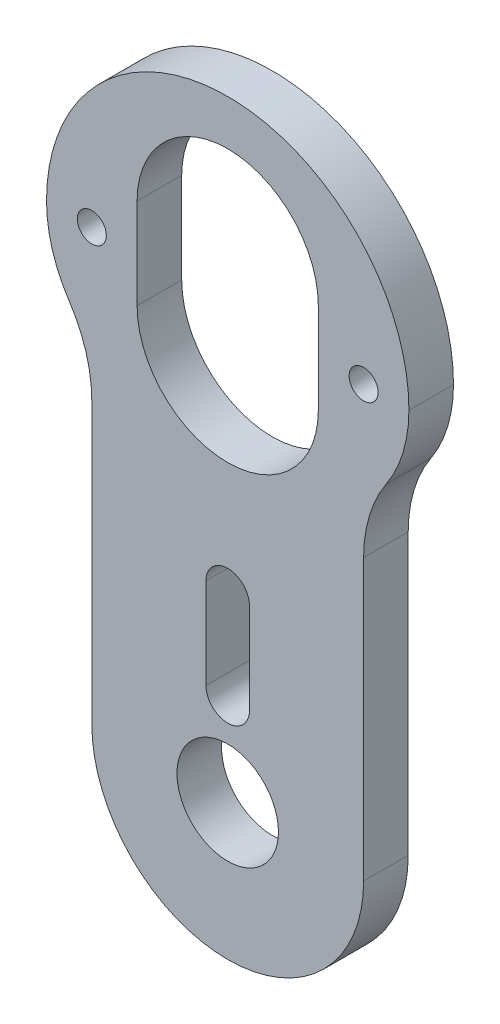
ISO-10303-21;
HEADER;
FILE_DESCRIPTION(('STEP AP214'),'2;1');
FILE_NAME('part.step','',(''),(''),'','','');
FILE_SCHEMA(('AUTOMOTIVE_DESIGN { 1 0 10303 214 1 1 1 1 }'));
ENDSEC;
DATA;
#1=APPLICATION_CONTEXT('core data for automotive mechanical design processes');
#2=APPLICATION_PROTOCOL_DEFINITION('international standard','automotive_design',2000,#1);
#3=PRODUCT_CONTEXT('',#1,'mechanical');
#4=PRODUCT('Part','Part','',(#3));
#5=PRODUCT_RELATED_PRODUCT_CATEGORY('part','',(#4));
#6=PRODUCT_DEFINITION_FORMATION('','',#4);
#7=PRODUCT_DEFINITION_CONTEXT('part definition',#1,'design');
#8=PRODUCT_DEFINITION('design','',#6,#7);
#9=PRODUCT_DEFINITION_SHAPE('','',#8);
#10=(LENGTH_UNIT() NAMED_UNIT(*) SI_UNIT(.MILLI.,.METRE.));
#11=(NAMED_UNIT(*) PLANE_ANGLE_UNIT() SI_UNIT($,.RADIAN.));
#12=(NAMED_UNIT(*) SI_UNIT($,.STERADIAN.) SOLID_ANGLE_UNIT());
#13=UNCERTAINTY_MEASURE_WITH_UNIT(LENGTH_MEASURE(1.E-05),#10,'distance_accuracy_value','');
#14=(GEOMETRIC_REPRESENTATION_CONTEXT(3) GLOBAL_UNCERTAINTY_ASSIGNED_CONTEXT((#13)) GLOBAL_UNIT_ASSIGNED_CONTEXT((#10,
#11,#12)) REPRESENTATION_CONTEXT('',''));
#15=CARTESIAN_POINT('',(0.,0.,0.));
#16=DIRECTION('',(0.,0.,1.));
#17=DIRECTION('',(1.,0.,0.));
#18=AXIS2_PLACEMENT_3D('',#15,#16,#17);
#19=CARTESIAN_POINT('',(9.525,0.,3.1242));
#20=DIRECTION('',(-1.,0.,0.));
#21=DIRECTION('',(0.,0.,1.));
#22=AXIS2_PLACEMENT_3D('',#19,#20,#21);
#23=PLANE('',#22);
#24=DIRECTION('',(0.,1.,0.));
#25=VECTOR('',#24,1.);
#26=CARTESIAN_POINT('',(9.525,0.,0.));
#27=LINE('',#26,#25);
#28=CARTESIAN_POINT('',(9.525,0.,0.));
#29=VERTEX_POINT('',#28);
#30=CARTESIAN_POINT('',(9.525,19.6322162906216,0.));
#31=VERTEX_POINT('',#30);
#32=EDGE_CURVE('E60',#29,#31,#27,.T.);
#33=ORIENTED_EDGE('',*,*,#32,.T.);
#34=DIRECTION('',(0.,0.,1.));
#35=VECTOR('',#34,1.);
#36=CARTESIAN_POINT('',(9.525,19.6322162906216,0.));
#37=LINE('',#36,#35);
#38=CARTESIAN_POINT('',(9.525,19.6322162906216,3.1242));
#39=VERTEX_POINT('',#38);
#40=EDGE_CURVE('E55',#31,#39,#37,.T.);
#41=ORIENTED_EDGE('',*,*,#40,.T.);
#42=DIRECTION('',(0.,1.,0.));
#43=VECTOR('',#42,1.);
#44=CARTESIAN_POINT('',(9.525,0.,3.1242));
#45=LINE('',#44,#43);
#46=CARTESIAN_POINT('',(9.525,0.,3.1242));
#47=VERTEX_POINT('',#46);
#48=EDGE_CURVE('E240',#47,#39,#45,.T.);
#49=ORIENTED_EDGE('',*,*,#48,.F.);
#50=DIRECTION('',(0.,0.,-1.));
#51=VECTOR('',#50,1.);
#52=CARTESIAN_POINT('',(9.525,0.,3.1242));
#53=LINE('',#52,#51);
#54=EDGE_CURVE('E47',#47,#29,#53,.T.);
#55=ORIENTED_EDGE('',*,*,#54,.T.);
#56=EDGE_LOOP('',(#33,#41,#49,#55));
#57=FACE_BOUND('',#56,.T.);
#58=ADVANCED_FACE('F38',(#57),#23,.F.);
#59=CARTESIAN_POINT('',(-9.525,0.,3.1242));
#60=DIRECTION('',(-1.,0.,0.));
#61=DIRECTION('',(0.,0.,1.));
#62=AXIS2_PLACEMENT_3D('',#59,#60,#61);
#63=PLANE('',#62);
#64=DIRECTION('',(0.,1.,0.));
#65=VECTOR('',#64,1.);
#66=CARTESIAN_POINT('',(-9.525,0.,3.1242));
#67=LINE('',#66,#65);
#68=CARTESIAN_POINT('',(-9.525,0.,3.1242));
#69=VERTEX_POINT('',#68);
#70=CARTESIAN_POINT('',(-9.525,19.6322162906216,3.1242));
#71=VERTEX_POINT('',#70);
#72=EDGE_CURVE('E242',#69,#71,#67,.T.);
#73=ORIENTED_EDGE('',*,*,#72,.T.);
#74=DIRECTION('',(0.,0.,1.));
#75=VECTOR('',#74,1.);
#76=CARTESIAN_POINT('',(-9.525,19.6322162906216,0.));
#77=LINE('',#76,#75);
#78=CARTESIAN_POINT('',(-9.525,19.6322162906216,0.));
#79=VERTEX_POINT('',#78);
#80=EDGE_CURVE('E205',#79,#71,#77,.T.);
#81=ORIENTED_EDGE('',*,*,#80,.F.);
#82=DIRECTION('',(0.,1.,0.));
#83=VECTOR('',#82,1.);
#84=CARTESIAN_POINT('',(-9.525,0.,0.));
#85=LINE('',#84,#83);
#86=CARTESIAN_POINT('',(-9.525,0.,0.));
#87=VERTEX_POINT('',#86);
#88=EDGE_CURVE('E273',#87,#79,#85,.T.);
#89=ORIENTED_EDGE('',*,*,#88,.F.);
#90=DIRECTION('',(0.,0.,-1.));
#91=VECTOR('',#90,1.);
#92=CARTESIAN_POINT('',(-9.525,0.,3.1242));
#93=LINE('',#92,#91);
#94=EDGE_CURVE('E11',#69,#87,#93,.T.);
#95=ORIENTED_EDGE('',*,*,#94,.F.);
#96=EDGE_LOOP('',(#73,#81,#89,#95));
#97=FACE_BOUND('',#96,.T.);
#98=ADVANCED_FACE('F341',(#97),#63,.T.);
#99=CARTESIAN_POINT('',(0.,12.7,3.1242));
#100=DIRECTION('',(0.,0.,-1.));
#101=DIRECTION('',(-1.,0.,0.));
#102=AXIS2_PLACEMENT_3D('',#99,#100,#101);
#103=CYLINDRICAL_SURFACE('',#102,1.524);
#104=CARTESIAN_POINT('',(0.,12.7,0.));
#105=DIRECTION('',(0.,0.,1.));
#106=DIRECTION('',(1.,0.,0.));
#107=AXIS2_PLACEMENT_3D('',#104,#105,#106);
#108=CIRCLE('',#107,1.524);
#109=CARTESIAN_POINT('',(1.524,12.7,0.));
#110=VERTEX_POINT('',#109);
#111=CARTESIAN_POINT('',(-1.524,12.7,0.));
#112=VERTEX_POINT('',#111);
#113=EDGE_CURVE('E257',#110,#112,#108,.T.);
#114=ORIENTED_EDGE('',*,*,#113,.F.);
#115=DIRECTION('',(0.,0.,-1.));
#116=VECTOR('',#115,1.);
#117=CARTESIAN_POINT('',(1.524,12.7,3.1242));
#118=LINE('',#117,#116);
#119=CARTESIAN_POINT('',(1.524,12.7,3.1242));
#120=VERTEX_POINT('',#119);
#121=EDGE_CURVE('E277',#120,#110,#118,.T.);
#122=ORIENTED_EDGE('',*,*,#121,.F.);
#123=CARTESIAN_POINT('',(0.,12.7,3.1242));
#124=DIRECTION('',(0.,0.,1.));
#125=DIRECTION('',(1.,0.,0.));
#126=AXIS2_PLACEMENT_3D('',#123,#124,#125);
#127=CIRCLE('',#126,1.524);
#128=CARTESIAN_POINT('',(-1.524,12.7,3.1242));
#129=VERTEX_POINT('',#128);
#130=EDGE_CURVE('E226',#120,#129,#127,.T.);
#131=ORIENTED_EDGE('',*,*,#130,.T.);
#132=DIRECTION('',(0.,0.,-1.));
#133=VECTOR('',#132,1.);
#134=CARTESIAN_POINT('',(-1.524,12.7,3.1242));
#135=LINE('',#134,#133);
#136=EDGE_CURVE('E279',#129,#112,#135,.T.);
#137=ORIENTED_EDGE('',*,*,#136,.T.);
#138=EDGE_LOOP('',(#114,#122,#131,#137));
#139=FACE_BOUND('',#138,.T.);
#140=ADVANCED_FACE('F347',(#139),#103,.F.);
#141=CARTESIAN_POINT('',(1.524,0.,3.1242));
#142=DIRECTION('',(-1.,0.,0.));
#143=DIRECTION('',(0.,0.,1.));
#144=AXIS2_PLACEMENT_3D('',#141,#142,#143);
#145=PLANE('',#144);
#146=DIRECTION('',(0.,1.,0.));
#147=VECTOR('',#146,1.);
#148=CARTESIAN_POINT('',(1.524,0.,0.));
#149=LINE('',#148,#147);
#150=CARTESIAN_POINT('',(1.524,6.35,0.));
#151=VERTEX_POINT('',#150);
#152=EDGE_CURVE('E260',#151,#110,#149,.T.);
#153=ORIENTED_EDGE('',*,*,#152,.F.);
#154=DIRECTION('',(0.,0.,-1.));
#155=VECTOR('',#154,1.);
#156=CARTESIAN_POINT('',(1.524,6.35,3.1242));
#157=LINE('',#156,#155);
#158=CARTESIAN_POINT('',(1.524,6.35,3.1242));
#159=VERTEX_POINT('',#158);
#160=EDGE_CURVE('E283',#159,#151,#157,.T.);
#161=ORIENTED_EDGE('',*,*,#160,.F.);
#162=DIRECTION('',(0.,1.,0.));
#163=VECTOR('',#162,1.);
#164=CARTESIAN_POINT('',(1.524,0.,3.1242));
#165=LINE('',#164,#163);
#166=EDGE_CURVE('E229',#159,#120,#165,.T.);
#167=ORIENTED_EDGE('',*,*,#166,.T.);
#168=ORIENTED_EDGE('',*,*,#121,.T.);
#169=EDGE_LOOP('',(#153,#161,#167,#168));
#170=FACE_BOUND('',#169,.T.);
#171=ADVANCED_FACE('F357',(#170),#145,.T.);
#172=CARTESIAN_POINT('',(0.,6.35,3.1242));
#173=DIRECTION('',(0.,0.,-1.));
#174=DIRECTION('',(-1.,0.,0.));
#175=AXIS2_PLACEMENT_3D('',#172,#173,#174);
#176=CYLINDRICAL_SURFACE('',#175,1.524);
#177=CARTESIAN_POINT('',(0.,6.35,0.));
#178=DIRECTION('',(0.,0.,1.));
#179=DIRECTION('',(1.,0.,0.));
#180=AXIS2_PLACEMENT_3D('',#177,#178,#179);
#181=CIRCLE('',#180,1.524);
#182=CARTESIAN_POINT('',(-1.524,6.35,0.));
#183=VERTEX_POINT('',#182);
#184=EDGE_CURVE('E263',#183,#151,#181,.T.);
#185=ORIENTED_EDGE('',*,*,#184,.F.);
#186=DIRECTION('',(0.,0.,-1.));
#187=VECTOR('',#186,1.);
#188=CARTESIAN_POINT('',(-1.524,6.35,3.1242));
#189=LINE('',#188,#187);
#190=CARTESIAN_POINT('',(-1.524,6.35,3.1242));
#191=VERTEX_POINT('',#190);
#192=EDGE_CURVE('E281',#191,#183,#189,.T.);
#193=ORIENTED_EDGE('',*,*,#192,.F.);
#194=CARTESIAN_POINT('',(0.,6.35,3.1242));
#195=DIRECTION('',(0.,0.,1.));
#196=DIRECTION('',(1.,0.,0.));
#197=AXIS2_PLACEMENT_3D('',#194,#195,#196);
#198=CIRCLE('',#197,1.524);
#199=EDGE_CURVE('E232',#191,#159,#198,.T.);
#200=ORIENTED_EDGE('',*,*,#199,.T.);
#201=ORIENTED_EDGE('',*,*,#160,.T.);
#202=EDGE_LOOP('',(#185,#193,#200,#201));
#203=FACE_BOUND('',#202,.T.);
#204=ADVANCED_FACE('F354',(#203),#176,.F.);
#205=CARTESIAN_POINT('',(0.,26.9875,3.1242));
#206=DIRECTION('',(0.,0.,-1.));
#207=DIRECTION('',(-1.,0.,0.));
#208=AXIS2_PLACEMENT_3D('',#205,#206,#207);
#209=CYLINDRICAL_SURFACE('',#208,6.35);
#210=DIRECTION('',(0.,0.,-1.));
#211=VECTOR('',#210,1.);
#212=CARTESIAN_POINT('',(6.35,26.9875,3.1242));
#213=LINE('',#212,#211);
#214=CARTESIAN_POINT('',(6.35,26.9875,3.1242));
#215=VERTEX_POINT('',#214);
#216=CARTESIAN_POINT('',(6.35,26.9875,0.));
#217=VERTEX_POINT('',#216);
#218=EDGE_CURVE('E247',#215,#217,#213,.T.);
#219=ORIENTED_EDGE('',*,*,#218,.T.);
#220=CARTESIAN_POINT('',(0.,26.9875,0.));
#221=DIRECTION('',(0.,0.,1.));
#222=DIRECTION('',(1.,0.,0.));
#223=AXIS2_PLACEMENT_3D('',#220,#221,#222);
#224=CIRCLE('',#223,6.35);
#225=CARTESIAN_POINT('',(-6.35,26.9875,0.));
#226=VERTEX_POINT('',#225);
#227=EDGE_CURVE('E207',#226,#217,#224,.T.);
#228=ORIENTED_EDGE('',*,*,#227,.F.);
#229=DIRECTION('',(0.,0.,-1.));
#230=VECTOR('',#229,1.);
#231=CARTESIAN_POINT('',(-6.35,26.9875,3.1242));
#232=LINE('',#231,#230);
#233=CARTESIAN_POINT('',(-6.35,26.9875,3.1242));
#234=VERTEX_POINT('',#233);
#235=EDGE_CURVE('E42',#234,#226,#232,.T.);
#236=ORIENTED_EDGE('',*,*,#235,.F.);
#237=CARTESIAN_POINT('',(0.,26.9875,3.1242));
#238=DIRECTION('',(0.,0.,1.));
#239=DIRECTION('',(1.,0.,0.));
#240=AXIS2_PLACEMENT_3D('',#237,#238,#239);
#241=CIRCLE('',#240,6.35);
#242=EDGE_CURVE('E215',#234,#215,#241,.T.);
#243=ORIENTED_EDGE('',*,*,#242,.T.);
#244=EDGE_LOOP('',(#219,#228,#236,#243));
#245=FACE_BOUND('',#244,.T.);
#246=ADVANCED_FACE('F40',(#245),#209,.F.);
#247=CARTESIAN_POINT('',(-6.35,0.,3.1242));
#248=DIRECTION('',(1.,0.,0.));
#249=DIRECTION('',(0.,0.,-1.));
#250=AXIS2_PLACEMENT_3D('',#247,#248,#249);
#251=PLANE('',#250);
#252=DIRECTION('',(0.,-1.,0.));
#253=VECTOR('',#252,1.);
#254=CARTESIAN_POINT('',(-6.35,0.,0.));
#255=LINE('',#254,#253);
#256=CARTESIAN_POINT('',(-6.35,33.3375,0.));
#257=VERTEX_POINT('',#256);
#258=EDGE_CURVE('E249',#257,#226,#255,.T.);
#259=ORIENTED_EDGE('',*,*,#258,.F.);
#260=DIRECTION('',(0.,0.,-1.));
#261=VECTOR('',#260,1.);
#262=CARTESIAN_POINT('',(-6.35,33.3375,3.1242));
#263=LINE('',#262,#261);
#264=CARTESIAN_POINT('',(-6.35,33.3375,3.1242));
#265=VERTEX_POINT('',#264);
#266=EDGE_CURVE('E289',#265,#257,#263,.T.);
#267=ORIENTED_EDGE('',*,*,#266,.F.);
#268=DIRECTION('',(0.,-1.,0.));
#269=VECTOR('',#268,1.);
#270=CARTESIAN_POINT('',(-6.35,0.,3.1242));
#271=LINE('',#270,#269);
#272=EDGE_CURVE('E217',#265,#234,#271,.T.);
#273=ORIENTED_EDGE('',*,*,#272,.T.);
#274=ORIENTED_EDGE('',*,*,#235,.T.);
#275=EDGE_LOOP('',(#259,#267,#273,#274));
#276=FACE_BOUND('',#275,.T.);
#277=ADVANCED_FACE('F297',(#276),#251,.T.);
#278=CARTESIAN_POINT('',(0.,33.3375,3.1242));
#279=DIRECTION('',(0.,0.,-1.));
#280=DIRECTION('',(-1.,0.,0.));
#281=AXIS2_PLACEMENT_3D('',#278,#279,#280);
#282=CYLINDRICAL_SURFACE('',#281,6.35);
#283=ORIENTED_EDGE('',*,*,#266,.T.);
#284=CARTESIAN_POINT('',(0.,33.3375,0.));
#285=DIRECTION('',(0.,0.,1.));
#286=DIRECTION('',(1.,0.,0.));
#287=AXIS2_PLACEMENT_3D('',#284,#285,#286);
#288=CIRCLE('',#287,6.35);
#289=CARTESIAN_POINT('',(6.35,33.3375,0.));
#290=VERTEX_POINT('',#289);
#291=EDGE_CURVE('E252',#290,#257,#288,.T.);
#292=ORIENTED_EDGE('',*,*,#291,.F.);
#293=DIRECTION('',(0.,0.,-1.));
#294=VECTOR('',#293,1.);
#295=CARTESIAN_POINT('',(6.35,33.3375,3.1242));
#296=LINE('',#295,#294);
#297=CARTESIAN_POINT('',(6.35,33.3375,3.1242));
#298=VERTEX_POINT('',#297);
#299=EDGE_CURVE('E288',#298,#290,#296,.T.);
#300=ORIENTED_EDGE('',*,*,#299,.F.);
#301=CARTESIAN_POINT('',(0.,33.3375,3.1242));
#302=DIRECTION('',(0.,0.,1.));
#303=DIRECTION('',(1.,0.,0.));
#304=AXIS2_PLACEMENT_3D('',#301,#302,#303);
#305=CIRCLE('',#304,6.35);
#306=EDGE_CURVE('E221',#298,#265,#305,.T.);
#307=ORIENTED_EDGE('',*,*,#306,.T.);
#308=EDGE_LOOP('',(#283,#292,#300,#307));
#309=FACE_BOUND('',#308,.T.);
#310=ADVANCED_FACE('F304',(#309),#282,.F.);
#311=CARTESIAN_POINT('',(0.,0.,3.1242));
#312=DIRECTION('',(0.,0.,-1.));
#313=DIRECTION('',(-1.,0.,0.));
#314=AXIS2_PLACEMENT_3D('',#311,#312,#313);
#315=CYLINDRICAL_SURFACE('',#314,3.556);
#316=CARTESIAN_POINT('',(0.,0.,3.1242));
#317=DIRECTION('',(0.,0.,1.));
#318=DIRECTION('',(1.,0.,0.));
#319=AXIS2_PLACEMENT_3D('',#316,#317,#318);
#320=CIRCLE('',#319,3.556);
#321=CARTESIAN_POINT('',(3.556,0.,3.1242));
#322=VERTEX_POINT('',#321);
#323=EDGE_CURVE('E237',#322,#322,#320,.T.);
#324=ORIENTED_EDGE('',*,*,#323,.T.);
#325=EDGE_LOOP('',(#324));
#326=FACE_BOUND('',#325,.T.);
#327=CARTESIAN_POINT('',(0.,0.,0.));
#328=DIRECTION('',(0.,0.,1.));
#329=DIRECTION('',(1.,0.,0.));
#330=AXIS2_PLACEMENT_3D('',#327,#328,#329);
#331=CIRCLE('',#330,3.556);
#332=CARTESIAN_POINT('',(3.556,0.,0.));
#333=VERTEX_POINT('',#332);
#334=EDGE_CURVE('E269',#333,#333,#331,.T.);
#335=ORIENTED_EDGE('',*,*,#334,.F.);
#336=EDGE_LOOP('',(#335));
#337=FACE_BOUND('',#336,.T.);
#338=ADVANCED_FACE('F321',(#326,#337),#315,.F.);
#339=CARTESIAN_POINT('',(-1.524,0.,3.1242));
#340=DIRECTION('',(-1.,0.,0.));
#341=DIRECTION('',(0.,0.,1.));
#342=AXIS2_PLACEMENT_3D('',#339,#340,#341);
#343=PLANE('',#342);
#344=DIRECTION('',(0.,1.,0.));
#345=VECTOR('',#344,1.);
#346=CARTESIAN_POINT('',(-1.524,0.,0.));
#347=LINE('',#346,#345);
#348=EDGE_CURVE('E266',#183,#112,#347,.T.);
#349=ORIENTED_EDGE('',*,*,#348,.T.);
#350=ORIENTED_EDGE('',*,*,#136,.F.);
#351=DIRECTION('',(0.,1.,0.));
#352=VECTOR('',#351,1.);
#353=CARTESIAN_POINT('',(-1.524,0.,3.1242));
#354=LINE('',#353,#352);
#355=EDGE_CURVE('E235',#191,#129,#354,.T.);
#356=ORIENTED_EDGE('',*,*,#355,.F.);
#357=ORIENTED_EDGE('',*,*,#192,.T.);
#358=EDGE_LOOP('',(#349,#350,#356,#357));
#359=FACE_BOUND('',#358,.T.);
#360=ADVANCED_FACE('F324',(#359),#343,.F.);
#361=CARTESIAN_POINT('',(6.35000000000001,0.,3.1242));
#362=DIRECTION('',(1.,0.,0.));
#363=DIRECTION('',(0.,1.,0.));
#364=AXIS2_PLACEMENT_3D('',#361,#362,#363);
#365=PLANE('',#364);
#366=DIRECTION('',(0.,-1.,0.));
#367=VECTOR('',#366,1.);
#368=CARTESIAN_POINT('',(6.35000000000001,0.,0.));
#369=LINE('',#368,#367);
#370=EDGE_CURVE('E254',#290,#217,#369,.T.);
#371=ORIENTED_EDGE('',*,*,#370,.T.);
#372=ORIENTED_EDGE('',*,*,#218,.F.);
#373=DIRECTION('',(0.,-1.,0.));
#374=VECTOR('',#373,1.);
#375=CARTESIAN_POINT('',(6.35000000000001,0.,3.1242));
#376=LINE('',#375,#374);
#377=EDGE_CURVE('E223',#298,#215,#376,.T.);
#378=ORIENTED_EDGE('',*,*,#377,.F.);
#379=ORIENTED_EDGE('',*,*,#299,.T.);
#380=EDGE_LOOP('',(#371,#372,#378,#379));
#381=FACE_BOUND('',#380,.T.);
#382=ADVANCED_FACE('F308',(#381),#365,.F.);
#383=CARTESIAN_POINT('',(0.,0.,3.1242));
#384=DIRECTION('',(0.,0.,-1.));
#385=DIRECTION('',(-1.,0.,0.));
#386=AXIS2_PLACEMENT_3D('',#383,#384,#385);
#387=CYLINDRICAL_SURFACE('',#386,9.525);
#388=CARTESIAN_POINT('',(0.,0.,0.));
#389=DIRECTION('',(0.,0.,1.));
#390=DIRECTION('',(1.,0.,0.));
#391=AXIS2_PLACEMENT_3D('',#388,#389,#390);
#392=CIRCLE('',#391,9.525);
#393=EDGE_CURVE('E218',#87,#29,#392,.T.);
#394=ORIENTED_EDGE('',*,*,#393,.T.);
#395=ORIENTED_EDGE('',*,*,#54,.F.);
#396=CARTESIAN_POINT('',(0.,0.,3.1242));
#397=DIRECTION('',(0.,0.,1.));
#398=DIRECTION('',(1.,0.,0.));
#399=AXIS2_PLACEMENT_3D('',#396,#397,#398);
#400=CIRCLE('',#399,9.525);
#401=EDGE_CURVE('E245',#69,#47,#400,.T.);
#402=ORIENTED_EDGE('',*,*,#401,.F.);
#403=ORIENTED_EDGE('',*,*,#94,.T.);
#404=EDGE_LOOP('',(#394,#395,#402,#403));
#405=FACE_BOUND('',#404,.T.);
#406=ADVANCED_FACE('F313',(#405),#387,.T.);
#407=CARTESIAN_POINT('',(0.,0.,3.1242));
#408=DIRECTION('',(0.,0.,1.));
#409=DIRECTION('',(1.,0.,0.));
#410=AXIS2_PLACEMENT_3D('',#407,#408,#409);
#411=PLANE('',#410);
#412=CARTESIAN_POINT('',(-9.525,30.1625,3.1242));
#413=DIRECTION('',(0.,0.,1.));
#414=DIRECTION('',(1.,0.,0.));
#415=AXIS2_PLACEMENT_3D('',#412,#413,#414);
#416=CIRCLE('',#415,1.016);
#417=CARTESIAN_POINT('',(-8.509,30.1625,3.1242));
#418=VERTEX_POINT('',#417);
#419=EDGE_CURVE('E202',#418,#418,#416,.T.);
#420=ORIENTED_EDGE('',*,*,#419,.F.);
#421=EDGE_LOOP('',(#420));
#422=FACE_BOUND('',#421,.T.);
#423=CARTESIAN_POINT('',(9.525,30.1625,3.1242));
#424=DIRECTION('',(0.,0.,1.));
#425=DIRECTION('',(1.,0.,0.));
#426=AXIS2_PLACEMENT_3D('',#423,#424,#425);
#427=CIRCLE('',#426,1.016);
#428=CARTESIAN_POINT('',(10.541,30.1625,3.1242));
#429=VERTEX_POINT('',#428);
#430=EDGE_CURVE('E188',#429,#429,#427,.T.);
#431=ORIENTED_EDGE('',*,*,#430,.F.);
#432=EDGE_LOOP('',(#431));
#433=FACE_BOUND('',#432,.T.);
#434=CARTESIAN_POINT('',(0.,30.1625,3.1242));
#435=DIRECTION('',(0.,0.,1.));
#436=DIRECTION('',(1.,0.,0.));
#437=AXIS2_PLACEMENT_3D('',#434,#435,#436);
#438=CIRCLE('',#437,12.7);
#439=CARTESIAN_POINT('',(-12.7,30.1625,3.1242));
#440=VERTEX_POINT('',#439);
#441=CARTESIAN_POINT('',(12.7,30.1625,3.1242));
#442=VERTEX_POINT('',#441);
#443=EDGE_CURVE('E194',#440,#442,#438,.F.);
#444=ORIENTED_EDGE('',*,*,#443,.F.);
#445=CARTESIAN_POINT('',(-3.175,30.1625,3.1242));
#446=DIRECTION('',(0.,0.,1.));
#447=DIRECTION('',(1.,0.,0.));
#448=AXIS2_PLACEMENT_3D('',#445,#446,#447);
#449=CIRCLE('',#448,9.525);
#450=CARTESIAN_POINT('',(-11.1125,24.8973581453108,3.1242));
#451=VERTEX_POINT('',#450);
#452=EDGE_CURVE('E196',#440,#451,#449,.T.);
#453=ORIENTED_EDGE('',*,*,#452,.T.);
#454=CARTESIAN_POINT('',(-19.05,19.6322162906216,3.1242));
#455=DIRECTION('',(0.,0.,1.));
#456=DIRECTION('',(1.,0.,0.));
#457=AXIS2_PLACEMENT_3D('',#454,#455,#456);
#458=CIRCLE('',#457,9.525);
#459=EDGE_CURVE('E199',#451,#71,#458,.F.);
#460=ORIENTED_EDGE('',*,*,#459,.T.);
#461=ORIENTED_EDGE('',*,*,#72,.F.);
#462=ORIENTED_EDGE('',*,*,#401,.T.);
#463=ORIENTED_EDGE('',*,*,#48,.T.);
#464=CARTESIAN_POINT('',(19.05,19.6322162906216,3.1242));
#465=DIRECTION('',(0.,0.,1.));
#466=DIRECTION('',(1.,0.,0.));
#467=AXIS2_PLACEMENT_3D('',#464,#465,#466);
#468=CIRCLE('',#467,9.525);
#469=CARTESIAN_POINT('',(11.1125,24.8973581453108,3.1242));
#470=VERTEX_POINT('',#469);
#471=EDGE_CURVE('E191',#470,#39,#468,.T.);
#472=ORIENTED_EDGE('',*,*,#471,.F.);
#473=CARTESIAN_POINT('',(3.175,30.1625,3.1242));
#474=DIRECTION('',(0.,0.,1.));
#475=DIRECTION('',(1.,0.,0.));
#476=AXIS2_PLACEMENT_3D('',#473,#474,#475);
#477=CIRCLE('',#476,9.525);
#478=EDGE_CURVE('E160',#470,#442,#477,.T.);
#479=ORIENTED_EDGE('',*,*,#478,.T.);
#480=EDGE_LOOP('',(#444,#453,#460,#461,#462,#463,#472,#479));
#481=FACE_BOUND('',#480,.T.);
#482=ORIENTED_EDGE('',*,*,#272,.F.);
#483=ORIENTED_EDGE('',*,*,#306,.F.);
#484=ORIENTED_EDGE('',*,*,#377,.T.);
#485=ORIENTED_EDGE('',*,*,#242,.F.);
#486=EDGE_LOOP('',(#482,#483,#484,#485));
#487=FACE_BOUND('',#486,.T.);
#488=ORIENTED_EDGE('',*,*,#130,.F.);
#489=ORIENTED_EDGE('',*,*,#166,.F.);
#490=ORIENTED_EDGE('',*,*,#199,.F.);
#491=ORIENTED_EDGE('',*,*,#355,.T.);
#492=EDGE_LOOP('',(#488,#489,#490,#491));
#493=FACE_BOUND('',#492,.T.);
#494=ORIENTED_EDGE('',*,*,#323,.F.);
#495=EDGE_LOOP('',(#494));
#496=FACE_BOUND('',#495,.T.);
#497=ADVANCED_FACE('F310',(#422,#433,#481,#487,#493,#496),#411,.T.);
#498=CARTESIAN_POINT('',(0.,0.,0.));
#499=DIRECTION('',(0.,0.,1.));
#500=DIRECTION('',(1.,0.,0.));
#501=AXIS2_PLACEMENT_3D('',#498,#499,#500);
#502=PLANE('',#501);
#503=CARTESIAN_POINT('',(9.525,30.1625,0.));
#504=DIRECTION('',(0.,0.,1.));
#505=DIRECTION('',(1.,0.,0.));
#506=AXIS2_PLACEMENT_3D('',#503,#504,#505);
#507=CIRCLE('',#506,1.016);
#508=CARTESIAN_POINT('',(10.541,30.1625,0.));
#509=VERTEX_POINT('',#508);
#510=EDGE_CURVE('E169',#509,#509,#507,.T.);
#511=ORIENTED_EDGE('',*,*,#510,.T.);
#512=EDGE_LOOP('',(#511));
#513=FACE_BOUND('',#512,.T.);
#514=CARTESIAN_POINT('',(-3.175,30.1625,0.));
#515=DIRECTION('',(0.,0.,1.));
#516=DIRECTION('',(1.,0.,0.));
#517=AXIS2_PLACEMENT_3D('',#514,#515,#516);
#518=CIRCLE('',#517,9.525);
#519=CARTESIAN_POINT('',(-12.7,30.1625,0.));
#520=VERTEX_POINT('',#519);
#521=CARTESIAN_POINT('',(-11.1125,24.8973581453108,0.));
#522=VERTEX_POINT('',#521);
#523=EDGE_CURVE('E177',#520,#522,#518,.T.);
#524=ORIENTED_EDGE('',*,*,#523,.F.);
#525=CARTESIAN_POINT('',(0.,30.1625,0.));
#526=DIRECTION('',(0.,0.,1.));
#527=DIRECTION('',(1.,0.,0.));
#528=AXIS2_PLACEMENT_3D('',#525,#526,#527);
#529=CIRCLE('',#528,12.7);
#530=CARTESIAN_POINT('',(12.7,30.1625,0.));
#531=VERTEX_POINT('',#530);
#532=EDGE_CURVE('E174',#520,#531,#529,.F.);
#533=ORIENTED_EDGE('',*,*,#532,.T.);
#534=CARTESIAN_POINT('',(3.175,30.1625,0.));
#535=DIRECTION('',(0.,0.,1.));
#536=DIRECTION('',(1.,0.,0.));
#537=AXIS2_PLACEMENT_3D('',#534,#535,#536);
#538=CIRCLE('',#537,9.525);
#539=CARTESIAN_POINT('',(11.1125,24.8973581453108,0.));
#540=VERTEX_POINT('',#539);
#541=EDGE_CURVE('E158',#540,#531,#538,.T.);
#542=ORIENTED_EDGE('',*,*,#541,.F.);
#543=CARTESIAN_POINT('',(19.05,19.6322162906216,0.));
#544=DIRECTION('',(0.,0.,1.));
#545=DIRECTION('',(1.,0.,0.));
#546=AXIS2_PLACEMENT_3D('',#543,#544,#545);
#547=CIRCLE('',#546,9.525);
#548=EDGE_CURVE('E166',#540,#31,#547,.T.);
#549=ORIENTED_EDGE('',*,*,#548,.T.);
#550=ORIENTED_EDGE('',*,*,#32,.F.);
#551=ORIENTED_EDGE('',*,*,#393,.F.);
#552=ORIENTED_EDGE('',*,*,#88,.T.);
#553=CARTESIAN_POINT('',(-19.05,19.6322162906216,0.));
#554=DIRECTION('',(0.,0.,1.));
#555=DIRECTION('',(1.,0.,0.));
#556=AXIS2_PLACEMENT_3D('',#553,#554,#555);
#557=CIRCLE('',#556,9.525);
#558=EDGE_CURVE('E183',#522,#79,#557,.F.);
#559=ORIENTED_EDGE('',*,*,#558,.F.);
#560=EDGE_LOOP('',(#524,#533,#542,#549,#550,#551,#552,#559));
#561=FACE_BOUND('',#560,.T.);
#562=ORIENTED_EDGE('',*,*,#291,.T.);
#563=ORIENTED_EDGE('',*,*,#258,.T.);
#564=ORIENTED_EDGE('',*,*,#227,.T.);
#565=ORIENTED_EDGE('',*,*,#370,.F.);
#566=EDGE_LOOP('',(#562,#563,#564,#565));
#567=FACE_BOUND('',#566,.T.);
#568=CARTESIAN_POINT('',(-9.525,30.1625,0.));
#569=DIRECTION('',(0.,0.,1.));
#570=DIRECTION('',(1.,0.,0.));
#571=AXIS2_PLACEMENT_3D('',#568,#569,#570);
#572=CIRCLE('',#571,1.016);
#573=CARTESIAN_POINT('',(-8.509,30.1625,0.));
#574=VERTEX_POINT('',#573);
#575=EDGE_CURVE('E185',#574,#574,#572,.T.);
#576=ORIENTED_EDGE('',*,*,#575,.T.);
#577=EDGE_LOOP('',(#576));
#578=FACE_BOUND('',#577,.T.);
#579=ORIENTED_EDGE('',*,*,#113,.T.);
#580=ORIENTED_EDGE('',*,*,#348,.F.);
#581=ORIENTED_EDGE('',*,*,#184,.T.);
#582=ORIENTED_EDGE('',*,*,#152,.T.);
#583=EDGE_LOOP('',(#579,#580,#581,#582));
#584=FACE_BOUND('',#583,.T.);
#585=ORIENTED_EDGE('',*,*,#334,.T.);
#586=EDGE_LOOP('',(#585));
#587=FACE_BOUND('',#586,.T.);
#588=ADVANCED_FACE('F172',(#513,#561,#567,#578,#584,#587),#502,.F.);
#589=CARTESIAN_POINT('',(0.,30.1625,0.));
#590=DIRECTION('',(0.,0.,1.));
#591=DIRECTION('',(1.,0.,0.));
#592=AXIS2_PLACEMENT_3D('',#589,#590,#591);
#593=CYLINDRICAL_SURFACE('',#592,12.7);
#594=ORIENTED_EDGE('',*,*,#532,.F.);
#595=DIRECTION('',(0.,0.,1.));
#596=VECTOR('',#595,1.);
#597=CARTESIAN_POINT('',(-12.7,30.1625,0.));
#598=LINE('',#597,#596);
#599=EDGE_CURVE('E210',#520,#440,#598,.T.);
#600=ORIENTED_EDGE('',*,*,#599,.T.);
#601=ORIENTED_EDGE('',*,*,#443,.T.);
#602=DIRECTION('',(0.,0.,1.));
#603=VECTOR('',#602,1.);
#604=CARTESIAN_POINT('',(12.7,30.1625,0.));
#605=LINE('',#604,#603);
#606=EDGE_CURVE('E164',#531,#442,#605,.T.);
#607=ORIENTED_EDGE('',*,*,#606,.F.);
#608=EDGE_LOOP('',(#594,#600,#601,#607));
#609=FACE_BOUND('',#608,.T.);
#610=ADVANCED_FACE('F329',(#609),#593,.T.);
#611=CARTESIAN_POINT('',(9.525,30.1625,0.));
#612=DIRECTION('',(0.,0.,1.));
#613=DIRECTION('',(1.,0.,0.));
#614=AXIS2_PLACEMENT_3D('',#611,#612,#613);
#615=CYLINDRICAL_SURFACE('',#614,1.016);
#616=ORIENTED_EDGE('',*,*,#430,.T.);
#617=EDGE_LOOP('',(#616));
#618=FACE_BOUND('',#617,.T.);
#619=ORIENTED_EDGE('',*,*,#510,.F.);
#620=EDGE_LOOP('',(#619));
#621=FACE_BOUND('',#620,.T.);
#622=ADVANCED_FACE('F335',(#618,#621),#615,.F.);
#623=CARTESIAN_POINT('',(-9.525,30.1625,0.));
#624=DIRECTION('',(0.,0.,1.));
#625=DIRECTION('',(1.,0.,0.));
#626=AXIS2_PLACEMENT_3D('',#623,#624,#625);
#627=CYLINDRICAL_SURFACE('',#626,1.016);
#628=ORIENTED_EDGE('',*,*,#419,.T.);
#629=EDGE_LOOP('',(#628));
#630=FACE_BOUND('',#629,.T.);
#631=ORIENTED_EDGE('',*,*,#575,.F.);
#632=EDGE_LOOP('',(#631));
#633=FACE_BOUND('',#632,.T.);
#634=ADVANCED_FACE('F398',(#630,#633),#627,.F.);
#635=CARTESIAN_POINT('',(-19.05,19.6322162906216,0.));
#636=DIRECTION('',(0.,0.,1.));
#637=DIRECTION('',(1.,0.,0.));
#638=AXIS2_PLACEMENT_3D('',#635,#636,#637);
#639=CYLINDRICAL_SURFACE('',#638,9.525);
#640=ORIENTED_EDGE('',*,*,#459,.F.);
#641=DIRECTION('',(0.,0.,1.));
#642=VECTOR('',#641,1.);
#643=CARTESIAN_POINT('',(-11.1125,24.8973581453108,0.));
#644=LINE('',#643,#642);
#645=EDGE_CURVE('E208',#522,#451,#644,.T.);
#646=ORIENTED_EDGE('',*,*,#645,.F.);
#647=ORIENTED_EDGE('',*,*,#558,.T.);
#648=ORIENTED_EDGE('',*,*,#80,.T.);
#649=EDGE_LOOP('',(#640,#646,#647,#648));
#650=FACE_BOUND('',#649,.T.);
#651=ADVANCED_FACE('F392',(#650),#639,.F.);
#652=CARTESIAN_POINT('',(-3.175,30.1625,0.));
#653=DIRECTION('',(0.,0.,1.));
#654=DIRECTION('',(1.,0.,0.));
#655=AXIS2_PLACEMENT_3D('',#652,#653,#654);
#656=CYLINDRICAL_SURFACE('',#655,9.525);
#657=ORIENTED_EDGE('',*,*,#452,.F.);
#658=ORIENTED_EDGE('',*,*,#599,.F.);
#659=ORIENTED_EDGE('',*,*,#523,.T.);
#660=ORIENTED_EDGE('',*,*,#645,.T.);
#661=EDGE_LOOP('',(#657,#658,#659,#660));
#662=FACE_BOUND('',#661,.T.);
#663=ADVANCED_FACE('F397',(#662),#656,.T.);
#664=CARTESIAN_POINT('',(3.175,30.1625,0.));
#665=DIRECTION('',(0.,0.,1.));
#666=DIRECTION('',(1.,0.,0.));
#667=AXIS2_PLACEMENT_3D('',#664,#665,#666);
#668=CYLINDRICAL_SURFACE('',#667,9.525);
#669=ORIENTED_EDGE('',*,*,#478,.F.);
#670=DIRECTION('',(0.,0.,1.));
#671=VECTOR('',#670,1.);
#672=CARTESIAN_POINT('',(11.1125,24.8973581453108,0.));
#673=LINE('',#672,#671);
#674=EDGE_CURVE('E153',#540,#470,#673,.T.);
#675=ORIENTED_EDGE('',*,*,#674,.F.);
#676=ORIENTED_EDGE('',*,*,#541,.T.);
#677=ORIENTED_EDGE('',*,*,#606,.T.);
#678=EDGE_LOOP('',(#669,#675,#676,#677));
#679=FACE_BOUND('',#678,.T.);
#680=ADVANCED_FACE('F155',(#679),#668,.T.);
#681=CARTESIAN_POINT('',(19.05,19.6322162906216,0.));
#682=DIRECTION('',(0.,0.,1.));
#683=DIRECTION('',(1.,0.,0.));
#684=AXIS2_PLACEMENT_3D('',#681,#682,#683);
#685=CYLINDRICAL_SURFACE('',#684,9.525);
#686=ORIENTED_EDGE('',*,*,#471,.T.);
#687=ORIENTED_EDGE('',*,*,#40,.F.);
#688=ORIENTED_EDGE('',*,*,#548,.F.);
#689=ORIENTED_EDGE('',*,*,#674,.T.);
#690=EDGE_LOOP('',(#686,#687,#688,#689));
#691=FACE_BOUND('',#690,.T.);
#692=ADVANCED_FACE('F167',(#691),#685,.F.);
#693=CLOSED_SHELL('',(#58,#98,#140,#171,#204,#246,#277,#310,#338,#360,#382,#406,#497,#588,#610,
#622,#634,#651,#663,#680,#692));
#694=MANIFOLD_SOLID_BREP('B2',#693);
#695=ADVANCED_BREP_SHAPE_REPRESENTATION('',(#18,#694),#14);
#696=SHAPE_DEFINITION_REPRESENTATION(#9,#695);
ENDSEC;
END-ISO-10303-21;
